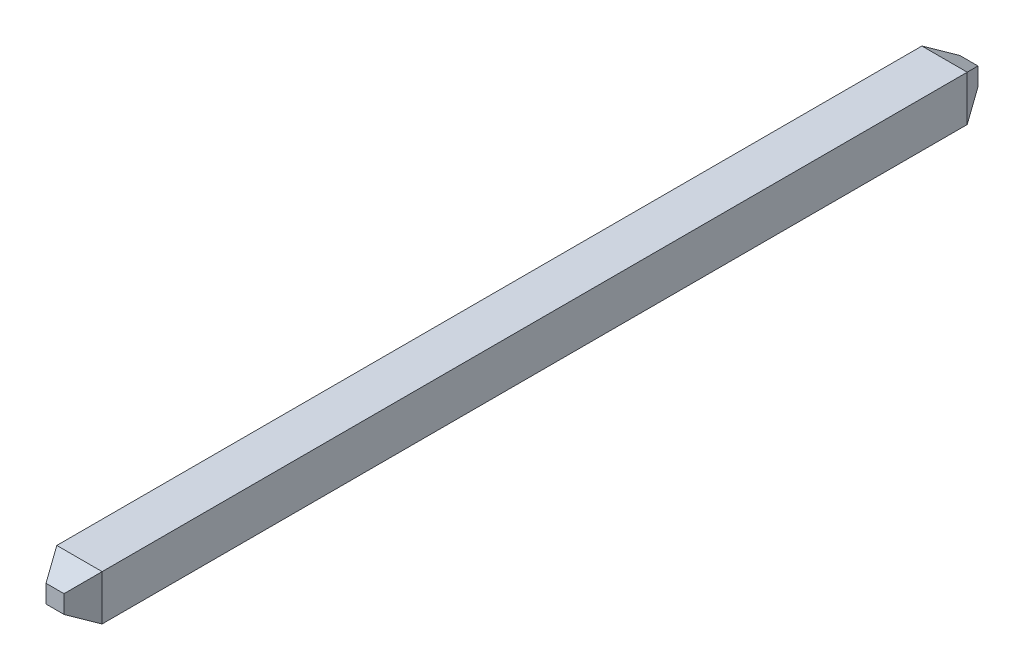
ISO-10303-21;
HEADER;
FILE_DESCRIPTION(('STEP AP214'),'2;1');
FILE_NAME('part.step','',(''),(''),'','','');
FILE_SCHEMA(('AUTOMOTIVE_DESIGN { 1 0 10303 214 1 1 1 1 }'));
ENDSEC;
DATA;
#1=APPLICATION_CONTEXT('core data for automotive mechanical design processes');
#2=APPLICATION_PROTOCOL_DEFINITION('international standard','automotive_design',2000,#1);
#3=PRODUCT_CONTEXT('',#1,'mechanical');
#4=PRODUCT('Part','Part','',(#3));
#5=PRODUCT_RELATED_PRODUCT_CATEGORY('part','',(#4));
#6=PRODUCT_DEFINITION_FORMATION('','',#4);
#7=PRODUCT_DEFINITION_CONTEXT('part definition',#1,'design');
#8=PRODUCT_DEFINITION('design','',#6,#7);
#9=PRODUCT_DEFINITION_SHAPE('','',#8);
#10=(LENGTH_UNIT() NAMED_UNIT(*) SI_UNIT(.MILLI.,.METRE.));
#11=(NAMED_UNIT(*) PLANE_ANGLE_UNIT() SI_UNIT($,.RADIAN.));
#12=(NAMED_UNIT(*) SI_UNIT($,.STERADIAN.) SOLID_ANGLE_UNIT());
#13=UNCERTAINTY_MEASURE_WITH_UNIT(LENGTH_MEASURE(1.E-05),#10,'distance_accuracy_value','');
#14=(GEOMETRIC_REPRESENTATION_CONTEXT(3) GLOBAL_UNCERTAINTY_ASSIGNED_CONTEXT((#13)) GLOBAL_UNIT_ASSIGNED_CONTEXT((#10,
#11,#12)) REPRESENTATION_CONTEXT('',''));
#15=CARTESIAN_POINT('',(0.,0.,0.));
#16=DIRECTION('',(0.,0.,1.));
#17=DIRECTION('',(1.,0.,0.));
#18=AXIS2_PLACEMENT_3D('',#15,#16,#17);
#19=CARTESIAN_POINT('',(2.66011510041924,-1.595,-3.20872569516347));
#20=DIRECTION('',(0.872569516347454,0.,-0.488489958076081));
#21=DIRECTION('',(-0.488489958076081,0.,-0.872569516347454));
#22=AXIS2_PLACEMENT_3D('',#19,#20,#21);
#23=PLANE('',#22);
#24=DIRECTION('',(0.,1.,0.));
#25=VECTOR('',#24,1.);
#26=CARTESIAN_POINT('',(2.85534185664468,-1.595,-2.86000017186176));
#27=LINE('',#26,#25);
#28=CARTESIAN_POINT('',(2.85534185663262,-1.58500002468493,-2.85999984563027));
#29=VERTEX_POINT('',#28);
#30=CARTESIAN_POINT('',(2.85534201729186,-0.954999839641339,-2.8599998849043));
#31=VERTEX_POINT('',#30);
#32=EDGE_CURVE('E118',#29,#31,#27,.T.);
#33=ORIENTED_EDGE('',*,*,#32,.F.);
#34=DIRECTION('',(0.439072617568647,-0.438284036988111,0.784297353956279));
#35=VECTOR('',#34,1.);
#36=CARTESIAN_POINT('',(2.665,-1.395,-3.2));
#37=LINE('',#36,#35);
#38=CARTESIAN_POINT('',(2.665,-1.395,-3.2));
#39=VERTEX_POINT('',#38);
#40=EDGE_CURVE('E116',#39,#29,#37,.T.);
#41=ORIENTED_EDGE('',*,*,#40,.F.);
#42=DIRECTION('',(0.,1.,0.));
#43=VECTOR('',#42,1.);
#44=CARTESIAN_POINT('',(2.665,-1.405,-3.2));
#45=LINE('',#44,#43);
#46=CARTESIAN_POINT('',(2.665,-1.145,-3.2));
#47=VERTEX_POINT('',#46);
#48=EDGE_CURVE('E79',#47,#39,#45,.F.);
#49=ORIENTED_EDGE('',*,*,#48,.F.);
#50=DIRECTION('',(-0.439072617568647,-0.438284036988111,-0.784297353956279));
#51=VECTOR('',#50,1.);
#52=CARTESIAN_POINT('',(2.85534185664468,-0.955000000000001,-2.86000017186176));
#53=LINE('',#52,#51);
#54=EDGE_CURVE('E110',#31,#47,#53,.T.);
#55=ORIENTED_EDGE('',*,*,#54,.F.);
#56=EDGE_LOOP('',(#33,#41,#49,#55));
#57=FACE_BOUND('',#56,.T.);
#58=ADVANCED_FACE('F17',(#57),#23,.T.);
#59=CARTESIAN_POINT('',(2.66036702814295,-1.595,9.50441734607014));
#60=DIRECTION('',(0.873317045523297,0.,0.487152273933376));
#61=DIRECTION('',(0.487152273933376,0.,-0.873317045523297));
#62=AXIS2_PLACEMENT_3D('',#59,#60,#61);
#63=PLANE('',#62);
#64=DIRECTION('',(-0.437799852400903,0.438586917260844,0.784839349959835));
#65=VECTOR('',#64,1.);
#66=CARTESIAN_POINT('',(2.85489789955164,-1.58500031317147,9.15568378706485));
#67=LINE('',#66,#65);
#68=CARTESIAN_POINT('',(2.85489765454992,-1.58500010892315,9.15568368845103));
#69=VERTEX_POINT('',#68);
#70=CARTESIAN_POINT('',(2.66523855088228,-1.395,9.49568417561491));
#71=VERTEX_POINT('',#70);
#72=EDGE_CURVE('E122',#69,#71,#67,.T.);
#73=ORIENTED_EDGE('',*,*,#72,.F.);
#74=DIRECTION('',(0.,1.,0.));
#75=VECTOR('',#74,1.);
#76=CARTESIAN_POINT('',(2.85489853900642,-1.595,9.155683722437));
#77=LINE('',#76,#75);
#78=CARTESIAN_POINT('',(2.8548976528046,-0.954999822967402,9.15568371270386));
#79=VERTEX_POINT('',#78);
#80=EDGE_CURVE('E89',#79,#69,#77,.F.);
#81=ORIENTED_EDGE('',*,*,#80,.F.);
#82=DIRECTION('',(0.437799852400902,0.438586917260844,-0.784839349959836));
#83=VECTOR('',#82,1.);
#84=CARTESIAN_POINT('',(2.66523855088228,-1.145,9.49568417561491));
#85=LINE('',#84,#83);
#86=CARTESIAN_POINT('',(2.66523855088228,-1.145,9.49568417561491));
#87=VERTEX_POINT('',#86);
#88=EDGE_CURVE('E84',#87,#79,#85,.T.);
#89=ORIENTED_EDGE('',*,*,#88,.F.);
#90=DIRECTION('',(0.,1.,0.));
#91=VECTOR('',#90,1.);
#92=CARTESIAN_POINT('',(2.66523855088228,-1.135,9.49568417561491));
#93=LINE('',#92,#91);
#94=EDGE_CURVE('E20',#71,#87,#93,.T.);
#95=ORIENTED_EDGE('',*,*,#94,.F.);
#96=EDGE_LOOP('',(#73,#81,#89,#95));
#97=FACE_BOUND('',#96,.T.);
#98=ADVANCED_FACE('F86',(#97),#63,.T.);
#99=CARTESIAN_POINT('',(2.40523855088228,-1.135,9.49568417561491));
#100=DIRECTION('',(0.,0.,1.));
#101=DIRECTION('',(1.,0.,0.));
#102=AXIS2_PLACEMENT_3D('',#99,#100,#101);
#103=PLANE('',#102);
#104=DIRECTION('',(1.,0.,0.));
#105=VECTOR('',#104,1.);
#106=CARTESIAN_POINT('',(2.2148966942376,-1.145,9.49568417561491));
#107=LINE('',#106,#105);
#108=CARTESIAN_POINT('',(2.41523855088228,-1.145,9.49568417561491));
#109=VERTEX_POINT('',#108);
#110=EDGE_CURVE('E93',#109,#87,#107,.T.);
#111=ORIENTED_EDGE('',*,*,#110,.F.);
#112=DIRECTION('',(0.,1.,0.));
#113=VECTOR('',#112,1.);
#114=CARTESIAN_POINT('',(2.41523855088228,-1.595,9.49568417561491));
#115=LINE('',#114,#113);
#116=CARTESIAN_POINT('',(2.41523855088228,-1.395,9.49568417561491));
#117=VERTEX_POINT('',#116);
#118=EDGE_CURVE('E129',#117,#109,#115,.T.);
#119=ORIENTED_EDGE('',*,*,#118,.F.);
#120=DIRECTION('',(1.,0.,0.));
#121=VECTOR('',#120,1.);
#122=CARTESIAN_POINT('',(2.2148966942376,-1.395,9.49568417561491));
#123=LINE('',#122,#121);
#124=EDGE_CURVE('E98',#71,#117,#123,.F.);
#125=ORIENTED_EDGE('',*,*,#124,.F.);
#126=ORIENTED_EDGE('',*,*,#94,.T.);
#127=EDGE_LOOP('',(#111,#119,#125,#126));
#128=FACE_BOUND('',#127,.T.);
#129=ADVANCED_FACE('F95',(#128),#103,.T.);
#130=CARTESIAN_POINT('',(2.2148966942376,-1.14987821545568,9.50441360938624));
#131=DIRECTION('',(0.,0.872943377132664,0.487821545567864));
#132=DIRECTION('',(0.,-0.487821545567864,0.872943377132664));
#133=AXIS2_PLACEMENT_3D('',#130,#131,#132);
#134=PLANE('',#133);
#135=DIRECTION('',(-0.439072459537933,0.438284700441648,-0.784297071672517));
#136=VECTOR('',#135,1.);
#137=CARTESIAN_POINT('',(2.41523855088228,-1.145,9.49568417561491));
#138=LINE('',#137,#136);
#139=CARTESIAN_POINT('',(2.2248975037028,-0.954999917527427,9.15568447138296));
#140=VERTEX_POINT('',#139);
#141=EDGE_CURVE('E102',#109,#140,#138,.T.);
#142=ORIENTED_EDGE('',*,*,#141,.F.);
#143=ORIENTED_EDGE('',*,*,#110,.T.);
#144=ORIENTED_EDGE('',*,*,#88,.T.);
#145=DIRECTION('',(1.,0.,0.));
#146=VECTOR('',#145,1.);
#147=CARTESIAN_POINT('',(2.54006658937282,-0.955,9.15568497320463));
#148=LINE('',#147,#146);
#149=EDGE_CURVE('E131',#140,#79,#148,.T.);
#150=ORIENTED_EDGE('',*,*,#149,.F.);
#151=EDGE_LOOP('',(#142,#143,#144,#150));
#152=FACE_BOUND('',#151,.T.);
#153=ADVANCED_FACE('F100',(#152),#134,.T.);
#154=CARTESIAN_POINT('',(2.405,-1.405,-3.2));
#155=DIRECTION('',(0.,0.,-1.));
#156=DIRECTION('',(-1.,0.,0.));
#157=AXIS2_PLACEMENT_3D('',#154,#155,#156);
#158=PLANE('',#157);
#159=ORIENTED_EDGE('',*,*,#48,.T.);
#160=DIRECTION('',(1.,0.,0.));
#161=VECTOR('',#160,1.);
#162=CARTESIAN_POINT('',(2.21534185664468,-1.395,-3.2));
#163=LINE('',#162,#161);
#164=CARTESIAN_POINT('',(2.415,-1.395,-3.2));
#165=VERTEX_POINT('',#164);
#166=EDGE_CURVE('E113',#165,#39,#163,.T.);
#167=ORIENTED_EDGE('',*,*,#166,.F.);
#168=DIRECTION('',(0.,1.,0.));
#169=VECTOR('',#168,1.);
#170=CARTESIAN_POINT('',(2.415,-1.595,-3.2));
#171=LINE('',#170,#169);
#172=CARTESIAN_POINT('',(2.415,-1.145,-3.2));
#173=VERTEX_POINT('',#172);
#174=EDGE_CURVE('E140',#173,#165,#171,.F.);
#175=ORIENTED_EDGE('',*,*,#174,.F.);
#176=DIRECTION('',(1.,0.,0.));
#177=VECTOR('',#176,1.);
#178=CARTESIAN_POINT('',(2.21534185664468,-1.145,-3.2));
#179=LINE('',#178,#177);
#180=EDGE_CURVE('E105',#47,#173,#179,.F.);
#181=ORIENTED_EDGE('',*,*,#180,.F.);
#182=EDGE_LOOP('',(#159,#167,#175,#181));
#183=FACE_BOUND('',#182,.T.);
#184=ADVANCED_FACE('F184',(#183),#158,.T.);
#185=CARTESIAN_POINT('',(2.21534185664468,-0.950121784544321,-2.85127073809043));
#186=DIRECTION('',(0.,0.872943377132663,-0.487821545567865));
#187=DIRECTION('',(0.,0.487821545567865,0.872943377132663));
#188=AXIS2_PLACEMENT_3D('',#185,#186,#187);
#189=PLANE('',#188);
#190=DIRECTION('',(1.,0.,0.));
#191=VECTOR('',#190,1.);
#192=CARTESIAN_POINT('',(2.54006658937282,-0.955,-2.86000017186176));
#193=LINE('',#192,#191);
#194=CARTESIAN_POINT('',(2.22534144768619,-0.954999293190895,-2.8599984305592));
#195=VERTEX_POINT('',#194);
#196=EDGE_CURVE('E137',#31,#195,#193,.F.);
#197=ORIENTED_EDGE('',*,*,#196,.F.);
#198=ORIENTED_EDGE('',*,*,#54,.T.);
#199=ORIENTED_EDGE('',*,*,#180,.T.);
#200=DIRECTION('',(0.437798396819591,-0.438586429089664,-0.784840434713052));
#201=VECTOR('',#200,1.);
#202=CARTESIAN_POINT('',(2.22534066407532,-0.954999279369218,-2.85999803394471));
#203=LINE('',#202,#201);
#204=EDGE_CURVE('E145',#195,#173,#203,.T.);
#205=ORIENTED_EDGE('',*,*,#204,.F.);
#206=EDGE_LOOP('',(#197,#198,#199,#205));
#207=FACE_BOUND('',#206,.T.);
#208=ADVANCED_FACE('F182',(#207),#189,.T.);
#209=CARTESIAN_POINT('',(2.21534185664468,-1.39012178454432,-3.20872943377133));
#210=DIRECTION('',(0.,-0.872943377132663,-0.487821545567865));
#211=DIRECTION('',(0.,0.487821545567865,-0.872943377132663));
#212=AXIS2_PLACEMENT_3D('',#209,#210,#211);
#213=PLANE('',#212);
#214=ORIENTED_EDGE('',*,*,#166,.T.);
#215=ORIENTED_EDGE('',*,*,#40,.T.);
#216=DIRECTION('',(1.,0.,0.));
#217=VECTOR('',#216,1.);
#218=CARTESIAN_POINT('',(2.21494834685547,-1.585,-2.85999756200982));
#219=LINE('',#218,#217);
#220=CARTESIAN_POINT('',(2.22534198218488,-1.58500027023654,-2.85999898491791));
#221=VERTEX_POINT('',#220);
#222=EDGE_CURVE('E35',#221,#29,#219,.T.);
#223=ORIENTED_EDGE('',*,*,#222,.F.);
#224=DIRECTION('',(-0.437798396819592,-0.438586429089661,0.784840434713054));
#225=VECTOR('',#224,1.);
#226=CARTESIAN_POINT('',(2.415,-1.395,-3.2));
#227=LINE('',#226,#225);
#228=EDGE_CURVE('E143',#165,#221,#227,.T.);
#229=ORIENTED_EDGE('',*,*,#228,.F.);
#230=EDGE_LOOP('',(#214,#215,#223,#229));
#231=FACE_BOUND('',#230,.T.);
#232=ADVANCED_FACE('F185',(#231),#213,.T.);
#233=CARTESIAN_POINT('',(2.85534630826875,-1.595,-2.98065701705514));
#234=DIRECTION('',(0.999999999319383,0.,3.68949151671631E-05));
#235=DIRECTION('',(3.68949151671631E-05,0.,-0.999999999319383));
#236=AXIS2_PLACEMENT_3D('',#233,#234,#235);
#237=PLANE('',#236);
#238=DIRECTION('',(3.69481335097372E-05,0.,-0.999999999317418));
#239=VECTOR('',#238,1.);
#240=CARTESIAN_POINT('',(2.85489789955164,-0.955,9.1556837224134));
#241=LINE('',#240,#239);
#242=EDGE_CURVE('E134',#79,#31,#241,.T.);
#243=ORIENTED_EDGE('',*,*,#242,.F.);
#244=ORIENTED_EDGE('',*,*,#80,.T.);
#245=DIRECTION('',(-3.69481335097372E-05,0.,0.999999999317418));
#246=VECTOR('',#245,1.);
#247=CARTESIAN_POINT('',(2.85534185664468,-1.585,-2.86000017186176));
#248=LINE('',#247,#246);
#249=EDGE_CURVE('E149',#29,#69,#248,.T.);
#250=ORIENTED_EDGE('',*,*,#249,.F.);
#251=ORIENTED_EDGE('',*,*,#32,.T.);
#252=EDGE_LOOP('',(#243,#244,#250,#251));
#253=FACE_BOUND('',#252,.T.);
#254=ADVANCED_FACE('F187',(#253),#237,.T.);
#255=CARTESIAN_POINT('',(2.2148966942376,-1.58987821545568,9.14695491370534));
#256=DIRECTION('',(0.,-0.872943377132664,0.487821545567864));
#257=DIRECTION('',(0.,-0.487821545567864,-0.872943377132664));
#258=AXIS2_PLACEMENT_3D('',#255,#256,#257);
#259=PLANE('',#258);
#260=ORIENTED_EDGE('',*,*,#124,.T.);
#261=DIRECTION('',(0.439072459537933,0.438284700441648,0.784297071672517));
#262=VECTOR('',#261,1.);
#263=CARTESIAN_POINT('',(2.22489724886554,-1.5849998023649,9.15568533818575));
#264=LINE('',#263,#262);
#265=CARTESIAN_POINT('',(2.22489781760237,-1.58499988392429,9.15568487573228));
#266=VERTEX_POINT('',#265);
#267=EDGE_CURVE('E126',#266,#117,#264,.T.);
#268=ORIENTED_EDGE('',*,*,#267,.F.);
#269=DIRECTION('',(1.,0.,0.));
#270=VECTOR('',#269,1.);
#271=CARTESIAN_POINT('',(2.21494834685547,-1.585,9.1556837224134));
#272=LINE('',#271,#270);
#273=EDGE_CURVE('E152',#69,#266,#272,.F.);
#274=ORIENTED_EDGE('',*,*,#273,.F.);
#275=ORIENTED_EDGE('',*,*,#72,.T.);
#276=EDGE_LOOP('',(#260,#268,#274,#275));
#277=FACE_BOUND('',#276,.T.);
#278=ADVANCED_FACE('F174',(#277),#259,.T.);
#279=CARTESIAN_POINT('',(2.42012345046304,-1.595,9.50440987077839));
#280=DIRECTION('',(-0.872569516347453,0.,0.488489958076081));
#281=DIRECTION('',(0.488489958076081,0.,0.872569516347453));
#282=AXIS2_PLACEMENT_3D('',#279,#280,#281);
#283=PLANE('',#282);
#284=ORIENTED_EDGE('',*,*,#267,.T.);
#285=ORIENTED_EDGE('',*,*,#118,.T.);
#286=ORIENTED_EDGE('',*,*,#141,.T.);
#287=DIRECTION('',(0.,1.,0.));
#288=VECTOR('',#287,1.);
#289=CARTESIAN_POINT('',(2.22489853896028,-1.595,9.15568497322818));
#290=LINE('',#289,#288);
#291=EDGE_CURVE('E155',#266,#140,#290,.T.);
#292=ORIENTED_EDGE('',*,*,#291,.F.);
#293=EDGE_LOOP('',(#284,#285,#286,#292));
#294=FACE_BOUND('',#293,.T.);
#295=ADVANCED_FACE('F177',(#294),#283,.T.);
#296=CARTESIAN_POINT('',(2.54006658937282,-0.955,9.32634470275115));
#297=DIRECTION('',(0.,1.,0.));
#298=DIRECTION('',(0.,0.,1.));
#299=AXIS2_PLACEMENT_3D('',#296,#297,#298);
#300=PLANE('',#299);
#301=ORIENTED_EDGE('',*,*,#196,.T.);
#302=DIRECTION('',(-3.68949151674615E-05,0.,0.999999999319383));
#303=VECTOR('',#302,1.);
#304=CARTESIAN_POINT('',(2.22489224235438,-0.955000197635096,9.32634821671993));
#305=LINE('',#304,#303);
#306=EDGE_CURVE('E158',#140,#195,#305,.F.);
#307=ORIENTED_EDGE('',*,*,#306,.F.);
#308=ORIENTED_EDGE('',*,*,#149,.T.);
#309=ORIENTED_EDGE('',*,*,#242,.T.);
#310=EDGE_LOOP('',(#301,#307,#308,#309));
#311=FACE_BOUND('',#310,.T.);
#312=ADVANCED_FACE('F179',(#311),#300,.T.);
#313=CARTESIAN_POINT('',(2.41987152273933,-1.595,-3.20873317045523));
#314=DIRECTION('',(-0.873317045523298,0.,-0.487152273933376));
#315=DIRECTION('',(-0.487152273933376,0.,0.873317045523298));
#316=AXIS2_PLACEMENT_3D('',#313,#314,#315);
#317=PLANE('',#316);
#318=DIRECTION('',(0.,1.,0.));
#319=VECTOR('',#318,1.);
#320=CARTESIAN_POINT('',(2.22534185654839,-1.595,-2.85999756199704));
#321=LINE('',#320,#319);
#322=EDGE_CURVE('E26',#195,#221,#321,.F.);
#323=ORIENTED_EDGE('',*,*,#322,.F.);
#324=ORIENTED_EDGE('',*,*,#204,.T.);
#325=ORIENTED_EDGE('',*,*,#174,.T.);
#326=ORIENTED_EDGE('',*,*,#228,.T.);
#327=EDGE_LOOP('',(#323,#324,#325,#326));
#328=FACE_BOUND('',#327,.T.);
#329=ADVANCED_FACE('F168',(#328),#317,.T.);
#330=CARTESIAN_POINT('',(2.21494834685547,-1.585,3.17284922525592));
#331=DIRECTION('',(0.,-1.,0.));
#332=DIRECTION('',(0.,0.,-1.));
#333=AXIS2_PLACEMENT_3D('',#330,#331,#332);
#334=PLANE('',#333);
#335=ORIENTED_EDGE('',*,*,#249,.T.);
#336=ORIENTED_EDGE('',*,*,#273,.T.);
#337=DIRECTION('',(-3.68949151674615E-05,0.,0.999999999319383));
#338=VECTOR('',#337,1.);
#339=CARTESIAN_POINT('',(2.22489224235438,-1.58500072063078,9.32634821671993));
#340=LINE('',#339,#338);
#341=EDGE_CURVE('E11',#221,#266,#340,.T.);
#342=ORIENTED_EDGE('',*,*,#341,.F.);
#343=ORIENTED_EDGE('',*,*,#222,.T.);
#344=EDGE_LOOP('',(#335,#336,#342,#343));
#345=FACE_BOUND('',#344,.T.);
#346=ADVANCED_FACE('F170',(#345),#334,.T.);
#347=CARTESIAN_POINT('',(2.22489224235438,-1.595,9.32634821671993));
#348=DIRECTION('',(-0.999999999319383,0.,-3.68949151674615E-05));
#349=DIRECTION('',(-3.68949151674615E-05,0.,0.999999999319383));
#350=AXIS2_PLACEMENT_3D('',#347,#348,#349);
#351=PLANE('',#350);
#352=ORIENTED_EDGE('',*,*,#322,.T.);
#353=ORIENTED_EDGE('',*,*,#341,.T.);
#354=ORIENTED_EDGE('',*,*,#291,.T.);
#355=ORIENTED_EDGE('',*,*,#306,.T.);
#356=EDGE_LOOP('',(#352,#353,#354,#355));
#357=FACE_BOUND('',#356,.T.);
#358=ADVANCED_FACE('F164',(#357),#351,.T.);
#359=CLOSED_SHELL('',(#58,#98,#129,#153,#184,#208,#232,#254,#278,#295,#312,#329,#346,#358));
#360=MANIFOLD_SOLID_BREP('B1',#359);
#361=ADVANCED_BREP_SHAPE_REPRESENTATION('',(#18,#360),#14);
#362=SHAPE_DEFINITION_REPRESENTATION(#9,#361);
ENDSEC;
END-ISO-10303-21;
